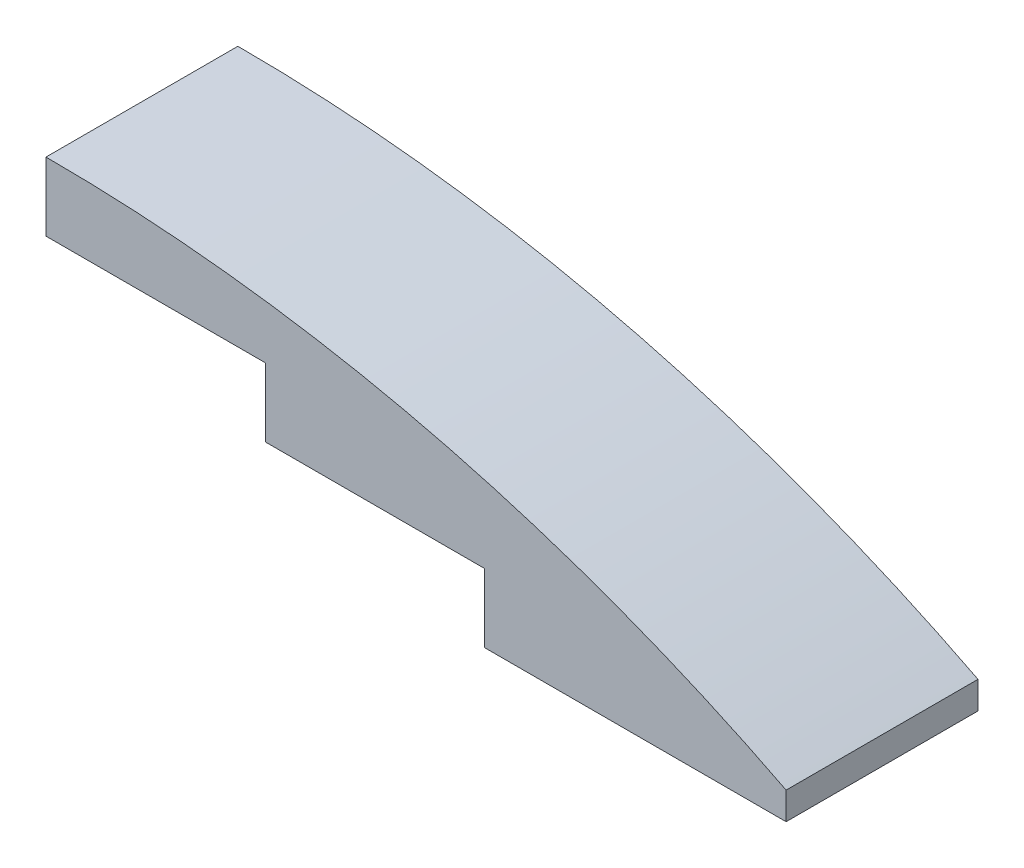
ISO-10303-21;
HEADER;
FILE_DESCRIPTION(('STEP AP214'),'2;1');
FILE_NAME('part.step','',(''),(''),'','','');
FILE_SCHEMA(('AUTOMOTIVE_DESIGN { 1 0 10303 214 1 1 1 1 }'));
ENDSEC;
DATA;
#1=APPLICATION_CONTEXT('core data for automotive mechanical design processes');
#2=APPLICATION_PROTOCOL_DEFINITION('international standard','automotive_design',2000,#1);
#3=PRODUCT_CONTEXT('',#1,'mechanical');
#4=PRODUCT('Part','Part','',(#3));
#5=PRODUCT_RELATED_PRODUCT_CATEGORY('part','',(#4));
#6=PRODUCT_DEFINITION_FORMATION('','',#4);
#7=PRODUCT_DEFINITION_CONTEXT('part definition',#1,'design');
#8=PRODUCT_DEFINITION('design','',#6,#7);
#9=PRODUCT_DEFINITION_SHAPE('','',#8);
#10=(LENGTH_UNIT() NAMED_UNIT(*) SI_UNIT(.MILLI.,.METRE.));
#11=(NAMED_UNIT(*) PLANE_ANGLE_UNIT() SI_UNIT($,.RADIAN.));
#12=(NAMED_UNIT(*) SI_UNIT($,.STERADIAN.) SOLID_ANGLE_UNIT());
#13=UNCERTAINTY_MEASURE_WITH_UNIT(LENGTH_MEASURE(1.E-05),#10,'distance_accuracy_value','');
#14=(GEOMETRIC_REPRESENTATION_CONTEXT(3) GLOBAL_UNCERTAINTY_ASSIGNED_CONTEXT((#13)) GLOBAL_UNIT_ASSIGNED_CONTEXT((#10,
#11,#12)) REPRESENTATION_CONTEXT('',''));
#15=CARTESIAN_POINT('',(0.,0.,0.));
#16=DIRECTION('',(0.,0.,1.));
#17=DIRECTION('',(1.,0.,0.));
#18=AXIS2_PLACEMENT_3D('',#15,#16,#17);
#19=CARTESIAN_POINT('',(0.,-75.3451923076923,4.445));
#20=DIRECTION('',(0.,0.,-1.));
#21=DIRECTION('',(-1.,0.,0.));
#22=AXIS2_PLACEMENT_3D('',#19,#20,#21);
#23=CYLINDRICAL_SURFACE('',#22,75.3451923076923);
#24=CARTESIAN_POINT('',(0.,-75.3451923076923,-4.445));
#25=DIRECTION('',(0.,0.,1.));
#26=DIRECTION('',(-1.,0.,0.));
#27=AXIS2_PLACEMENT_3D('',#24,#25,#26);
#28=CIRCLE('',#27,75.3451923076923);
#29=CARTESIAN_POINT('',(34.29,-8.255,-4.445));
#30=VERTEX_POINT('',#29);
#31=CARTESIAN_POINT('',(0.,0.,-4.445));
#32=VERTEX_POINT('',#31);
#33=EDGE_CURVE('E255',#30,#32,#28,.T.);
#34=ORIENTED_EDGE('',*,*,#33,.T.);
#35=DIRECTION('',(0.,0.,-1.));
#36=VECTOR('',#35,1.);
#37=CARTESIAN_POINT('',(0.,0.,4.445));
#38=LINE('',#37,#36);
#39=CARTESIAN_POINT('',(0.,0.,4.445));
#40=VERTEX_POINT('',#39);
#41=EDGE_CURVE('E12',#40,#32,#38,.T.);
#42=ORIENTED_EDGE('',*,*,#41,.F.);
#43=CARTESIAN_POINT('',(0.,-75.3451923076923,4.445));
#44=DIRECTION('',(0.,0.,1.));
#45=DIRECTION('',(-1.,0.,0.));
#46=AXIS2_PLACEMENT_3D('',#43,#44,#45);
#47=CIRCLE('',#46,75.3451923076923);
#48=CARTESIAN_POINT('',(34.29,-8.255,4.445));
#49=VERTEX_POINT('',#48);
#50=EDGE_CURVE('E256',#49,#40,#47,.T.);
#51=ORIENTED_EDGE('',*,*,#50,.F.);
#52=DIRECTION('',(0.,0.,-1.));
#53=VECTOR('',#52,1.);
#54=CARTESIAN_POINT('',(34.29,-8.255,4.445));
#55=LINE('',#54,#53);
#56=EDGE_CURVE('E274',#49,#30,#55,.T.);
#57=ORIENTED_EDGE('',*,*,#56,.T.);
#58=EDGE_LOOP('',(#34,#42,#51,#57));
#59=FACE_BOUND('',#58,.T.);
#60=ADVANCED_FACE('F35',(#59),#23,.T.);
#61=CARTESIAN_POINT('',(0.,0.,4.445));
#62=DIRECTION('',(1.,0.,0.));
#63=DIRECTION('',(0.,1.,0.));
#64=AXIS2_PLACEMENT_3D('',#61,#62,#63);
#65=PLANE('',#64);
#66=DIRECTION('',(0.,-1.,0.));
#67=VECTOR('',#66,1.);
#68=CARTESIAN_POINT('',(0.,0.,-4.445));
#69=LINE('',#68,#67);
#70=CARTESIAN_POINT('',(0.,-3.175,-4.445));
#71=VERTEX_POINT('',#70);
#72=EDGE_CURVE('E277',#32,#71,#69,.T.);
#73=ORIENTED_EDGE('',*,*,#72,.T.);
#74=DIRECTION('',(0.,0.,-1.));
#75=VECTOR('',#74,1.);
#76=CARTESIAN_POINT('',(0.,-3.175,4.445));
#77=LINE('',#76,#75);
#78=CARTESIAN_POINT('',(0.,-3.175,4.445));
#79=VERTEX_POINT('',#78);
#80=EDGE_CURVE('E42',#79,#71,#77,.T.);
#81=ORIENTED_EDGE('',*,*,#80,.F.);
#82=DIRECTION('',(0.,-1.,0.));
#83=VECTOR('',#82,1.);
#84=CARTESIAN_POINT('',(0.,0.,4.445));
#85=LINE('',#84,#83);
#86=EDGE_CURVE('E259',#40,#79,#85,.T.);
#87=ORIENTED_EDGE('',*,*,#86,.F.);
#88=ORIENTED_EDGE('',*,*,#41,.T.);
#89=EDGE_LOOP('',(#73,#81,#87,#88));
#90=FACE_BOUND('',#89,.T.);
#91=ADVANCED_FACE('F370',(#90),#65,.F.);
#92=CARTESIAN_POINT('',(0.,-3.175,4.445));
#93=DIRECTION('',(0.,1.,0.));
#94=DIRECTION('',(0.,0.,1.));
#95=AXIS2_PLACEMENT_3D('',#92,#93,#94);
#96=PLANE('',#95);
#97=DIRECTION('',(0.,0.,-1.));
#98=VECTOR('',#97,1.);
#99=CARTESIAN_POINT('',(0.3175,-3.175,0.));
#100=LINE('',#99,#98);
#101=CARTESIAN_POINT('',(0.3175,-3.175,4.1275));
#102=VERTEX_POINT('',#101);
#103=CARTESIAN_POINT('',(0.3175,-3.175,-4.1275));
#104=VERTEX_POINT('',#103);
#105=EDGE_CURVE('E241',#102,#104,#100,.T.);
#106=ORIENTED_EDGE('',*,*,#105,.F.);
#107=DIRECTION('',(-1.,0.,0.));
#108=VECTOR('',#107,1.);
#109=CARTESIAN_POINT('',(0.,-3.175,4.1275));
#110=LINE('',#109,#108);
#111=CARTESIAN_POINT('',(10.16,-3.175,4.1275));
#112=VERTEX_POINT('',#111);
#113=EDGE_CURVE('E230',#112,#102,#110,.T.);
#114=ORIENTED_EDGE('',*,*,#113,.F.);
#115=DIRECTION('',(0.,0.,-1.));
#116=VECTOR('',#115,1.);
#117=CARTESIAN_POINT('',(10.16,-3.175,4.445));
#118=LINE('',#117,#116);
#119=CARTESIAN_POINT('',(10.16,-3.175,4.445));
#120=VERTEX_POINT('',#119);
#121=EDGE_CURVE('E308',#120,#112,#118,.T.);
#122=ORIENTED_EDGE('',*,*,#121,.F.);
#123=DIRECTION('',(1.,0.,0.));
#124=VECTOR('',#123,1.);
#125=CARTESIAN_POINT('',(0.,-3.175,4.445));
#126=LINE('',#125,#124);
#127=EDGE_CURVE('E262',#79,#120,#126,.T.);
#128=ORIENTED_EDGE('',*,*,#127,.F.);
#129=ORIENTED_EDGE('',*,*,#80,.T.);
#130=DIRECTION('',(1.,0.,0.));
#131=VECTOR('',#130,1.);
#132=CARTESIAN_POINT('',(0.,-3.175,-4.445));
#133=LINE('',#132,#131);
#134=CARTESIAN_POINT('',(10.16,-3.175,-4.445));
#135=VERTEX_POINT('',#134);
#136=EDGE_CURVE('E279',#71,#135,#133,.T.);
#137=ORIENTED_EDGE('',*,*,#136,.T.);
#138=CARTESIAN_POINT('',(10.16,-3.175,-4.1275));
#139=VERTEX_POINT('',#138);
#140=EDGE_CURVE('E307',#139,#135,#118,.T.);
#141=ORIENTED_EDGE('',*,*,#140,.F.);
#142=DIRECTION('',(1.,0.,0.));
#143=VECTOR('',#142,1.);
#144=CARTESIAN_POINT('',(0.,-3.175,-4.1275));
#145=LINE('',#144,#143);
#146=EDGE_CURVE('E244',#104,#139,#145,.T.);
#147=ORIENTED_EDGE('',*,*,#146,.F.);
#148=EDGE_LOOP('',(#106,#114,#122,#128,#129,#137,#141,#147));
#149=FACE_BOUND('',#148,.T.);
#150=ADVANCED_FACE('F316',(#149),#96,.F.);
#151=CARTESIAN_POINT('',(10.16,-3.175,4.445));
#152=DIRECTION('',(1.,0.,0.));
#153=DIRECTION('',(0.,1.,0.));
#154=AXIS2_PLACEMENT_3D('',#151,#152,#153);
#155=PLANE('',#154);
#156=DIRECTION('',(0.,-1.,0.));
#157=VECTOR('',#156,1.);
#158=CARTESIAN_POINT('',(10.16,-3.175,-4.445));
#159=LINE('',#158,#157);
#160=CARTESIAN_POINT('',(10.16,-6.35,-4.445));
#161=VERTEX_POINT('',#160);
#162=EDGE_CURVE('E282',#135,#161,#159,.T.);
#163=ORIENTED_EDGE('',*,*,#162,.T.);
#164=DIRECTION('',(0.,0.,-1.));
#165=VECTOR('',#164,1.);
#166=CARTESIAN_POINT('',(10.16,-6.35,4.445));
#167=LINE('',#166,#165);
#168=CARTESIAN_POINT('',(10.16,-6.35,4.445));
#169=VERTEX_POINT('',#168);
#170=EDGE_CURVE('E304',#169,#161,#167,.T.);
#171=ORIENTED_EDGE('',*,*,#170,.F.);
#172=DIRECTION('',(0.,-1.,0.));
#173=VECTOR('',#172,1.);
#174=CARTESIAN_POINT('',(10.16,-3.175,4.445));
#175=LINE('',#174,#173);
#176=EDGE_CURVE('E264',#120,#169,#175,.T.);
#177=ORIENTED_EDGE('',*,*,#176,.F.);
#178=ORIENTED_EDGE('',*,*,#121,.T.);
#179=DIRECTION('',(0.,-1.,0.));
#180=VECTOR('',#179,1.);
#181=CARTESIAN_POINT('',(10.16,2.541,4.1275));
#182=LINE('',#181,#180);
#183=CARTESIAN_POINT('',(10.16,-1.97007039691387,4.1275));
#184=VERTEX_POINT('',#183);
#185=EDGE_CURVE('E234',#184,#112,#182,.T.);
#186=ORIENTED_EDGE('',*,*,#185,.F.);
#187=DIRECTION('',(0.,0.,-1.));
#188=VECTOR('',#187,1.);
#189=CARTESIAN_POINT('',(10.16,-1.97007039691387,4.445));
#190=LINE('',#189,#188);
#191=CARTESIAN_POINT('',(10.16,-1.97007039691387,-4.1275));
#192=VERTEX_POINT('',#191);
#193=EDGE_CURVE('E233',#184,#192,#190,.T.);
#194=ORIENTED_EDGE('',*,*,#193,.T.);
#195=DIRECTION('',(0.,-1.,0.));
#196=VECTOR('',#195,1.);
#197=CARTESIAN_POINT('',(10.16,2.541,-4.1275));
#198=LINE('',#197,#196);
#199=EDGE_CURVE('E248',#192,#139,#198,.T.);
#200=ORIENTED_EDGE('',*,*,#199,.T.);
#201=ORIENTED_EDGE('',*,*,#140,.T.);
#202=EDGE_LOOP('',(#163,#171,#177,#178,#186,#194,#200,#201));
#203=FACE_BOUND('',#202,.T.);
#204=ADVANCED_FACE('F328',(#203),#155,.F.);
#205=CARTESIAN_POINT('',(10.16,-6.35,4.445));
#206=DIRECTION('',(0.,1.,0.));
#207=DIRECTION('',(0.,0.,1.));
#208=AXIS2_PLACEMENT_3D('',#205,#206,#207);
#209=PLANE('',#208);
#210=DIRECTION('',(0.,0.,-1.));
#211=VECTOR('',#210,1.);
#212=CARTESIAN_POINT('',(10.4775,-6.35,0.));
#213=LINE('',#212,#211);
#214=CARTESIAN_POINT('',(10.4775,-6.35,4.1275));
#215=VERTEX_POINT('',#214);
#216=CARTESIAN_POINT('',(10.4775,-6.35,-4.1275));
#217=VERTEX_POINT('',#216);
#218=EDGE_CURVE('E199',#215,#217,#213,.T.);
#219=ORIENTED_EDGE('',*,*,#218,.F.);
#220=DIRECTION('',(-1.,0.,0.));
#221=VECTOR('',#220,1.);
#222=CARTESIAN_POINT('',(0.,-6.35,4.1275));
#223=LINE('',#222,#221);
#224=CARTESIAN_POINT('',(20.32,-6.35,4.1275));
#225=VERTEX_POINT('',#224);
#226=EDGE_CURVE('E195',#225,#215,#223,.T.);
#227=ORIENTED_EDGE('',*,*,#226,.F.);
#228=DIRECTION('',(0.,0.,-1.));
#229=VECTOR('',#228,1.);
#230=CARTESIAN_POINT('',(20.32,-6.35,4.445));
#231=LINE('',#230,#229);
#232=CARTESIAN_POINT('',(20.32,-6.35,4.445));
#233=VERTEX_POINT('',#232);
#234=EDGE_CURVE('E301',#233,#225,#231,.T.);
#235=ORIENTED_EDGE('',*,*,#234,.F.);
#236=DIRECTION('',(1.,0.,0.));
#237=VECTOR('',#236,1.);
#238=CARTESIAN_POINT('',(10.16,-6.35,4.445));
#239=LINE('',#238,#237);
#240=EDGE_CURVE('E266',#169,#233,#239,.T.);
#241=ORIENTED_EDGE('',*,*,#240,.F.);
#242=ORIENTED_EDGE('',*,*,#170,.T.);
#243=DIRECTION('',(1.,0.,0.));
#244=VECTOR('',#243,1.);
#245=CARTESIAN_POINT('',(10.16,-6.35,-4.445));
#246=LINE('',#245,#244);
#247=CARTESIAN_POINT('',(20.32,-6.35,-4.445));
#248=VERTEX_POINT('',#247);
#249=EDGE_CURVE('E284',#161,#248,#246,.T.);
#250=ORIENTED_EDGE('',*,*,#249,.T.);
#251=CARTESIAN_POINT('',(20.32,-6.35,-4.1275));
#252=VERTEX_POINT('',#251);
#253=EDGE_CURVE('E300',#252,#248,#231,.T.);
#254=ORIENTED_EDGE('',*,*,#253,.F.);
#255=DIRECTION('',(1.,0.,0.));
#256=VECTOR('',#255,1.);
#257=CARTESIAN_POINT('',(0.,-6.35,-4.1275));
#258=LINE('',#257,#256);
#259=EDGE_CURVE('E57',#217,#252,#258,.T.);
#260=ORIENTED_EDGE('',*,*,#259,.F.);
#261=EDGE_LOOP('',(#219,#227,#235,#241,#242,#250,#254,#260));
#262=FACE_BOUND('',#261,.T.);
#263=ADVANCED_FACE('F333',(#262),#209,.F.);
#264=CARTESIAN_POINT('',(20.32,-6.35,4.445));
#265=DIRECTION('',(1.,0.,0.));
#266=DIRECTION('',(0.,1.,0.));
#267=AXIS2_PLACEMENT_3D('',#264,#265,#266);
#268=PLANE('',#267);
#269=DIRECTION('',(0.,-1.,0.));
#270=VECTOR('',#269,1.);
#271=CARTESIAN_POINT('',(20.32,-6.35,-4.445));
#272=LINE('',#271,#270);
#273=CARTESIAN_POINT('',(20.32,-9.525,-4.445));
#274=VERTEX_POINT('',#273);
#275=EDGE_CURVE('E287',#248,#274,#272,.T.);
#276=ORIENTED_EDGE('',*,*,#275,.T.);
#277=DIRECTION('',(0.,0.,-1.));
#278=VECTOR('',#277,1.);
#279=CARTESIAN_POINT('',(20.32,-9.525,4.445));
#280=LINE('',#279,#278);
#281=CARTESIAN_POINT('',(20.32,-9.525,4.445));
#282=VERTEX_POINT('',#281);
#283=EDGE_CURVE('E297',#282,#274,#280,.T.);
#284=ORIENTED_EDGE('',*,*,#283,.F.);
#285=DIRECTION('',(0.,-1.,0.));
#286=VECTOR('',#285,1.);
#287=CARTESIAN_POINT('',(20.32,-6.35,4.445));
#288=LINE('',#287,#286);
#289=EDGE_CURVE('E268',#233,#282,#288,.T.);
#290=ORIENTED_EDGE('',*,*,#289,.F.);
#291=ORIENTED_EDGE('',*,*,#234,.T.);
#292=DIRECTION('',(0.,-1.,0.));
#293=VECTOR('',#292,1.);
#294=CARTESIAN_POINT('',(20.32,2.541,4.1275));
#295=LINE('',#294,#293);
#296=CARTESIAN_POINT('',(20.32,-4.11155056854212,4.1275));
#297=VERTEX_POINT('',#296);
#298=EDGE_CURVE('E214',#297,#225,#295,.T.);
#299=ORIENTED_EDGE('',*,*,#298,.F.);
#300=DIRECTION('',(0.,0.,-1.));
#301=VECTOR('',#300,1.);
#302=CARTESIAN_POINT('',(20.32,-4.11155056854212,4.445));
#303=LINE('',#302,#301);
#304=CARTESIAN_POINT('',(20.32,-4.11155056854212,-4.1275));
#305=VERTEX_POINT('',#304);
#306=EDGE_CURVE('E213',#297,#305,#303,.T.);
#307=ORIENTED_EDGE('',*,*,#306,.T.);
#308=DIRECTION('',(0.,-1.,0.));
#309=VECTOR('',#308,1.);
#310=CARTESIAN_POINT('',(20.32,2.541,-4.1275));
#311=LINE('',#310,#309);
#312=EDGE_CURVE('E224',#305,#252,#311,.T.);
#313=ORIENTED_EDGE('',*,*,#312,.T.);
#314=ORIENTED_EDGE('',*,*,#253,.T.);
#315=EDGE_LOOP('',(#276,#284,#290,#291,#299,#307,#313,#314));
#316=FACE_BOUND('',#315,.T.);
#317=ADVANCED_FACE('F388',(#316),#268,.F.);
#318=CARTESIAN_POINT('',(20.32,-9.525,4.445));
#319=DIRECTION('',(0.,1.,0.));
#320=DIRECTION('',(0.,0.,1.));
#321=AXIS2_PLACEMENT_3D('',#318,#319,#320);
#322=PLANE('',#321);
#323=DIRECTION('',(0.,0.,-1.));
#324=VECTOR('',#323,1.);
#325=CARTESIAN_POINT('',(20.6375,-9.525,0.));
#326=LINE('',#325,#324);
#327=CARTESIAN_POINT('',(20.6375,-9.525,4.1275));
#328=VERTEX_POINT('',#327);
#329=CARTESIAN_POINT('',(20.6375,-9.525,-4.1275));
#330=VERTEX_POINT('',#329);
#331=EDGE_CURVE('E177',#328,#330,#326,.T.);
#332=ORIENTED_EDGE('',*,*,#331,.F.);
#333=DIRECTION('',(-1.,0.,0.));
#334=VECTOR('',#333,1.);
#335=CARTESIAN_POINT('',(0.,-9.525,4.1275));
#336=LINE('',#335,#334);
#337=CARTESIAN_POINT('',(33.9725,-9.525,4.1275));
#338=VERTEX_POINT('',#337);
#339=EDGE_CURVE('E49',#338,#328,#336,.T.);
#340=ORIENTED_EDGE('',*,*,#339,.F.);
#341=DIRECTION('',(0.,0.,1.));
#342=VECTOR('',#341,1.);
#343=CARTESIAN_POINT('',(33.9725,-9.525,0.));
#344=LINE('',#343,#342);
#345=CARTESIAN_POINT('',(33.9725,-9.525,-4.1275));
#346=VERTEX_POINT('',#345);
#347=EDGE_CURVE('E191',#346,#338,#344,.T.);
#348=ORIENTED_EDGE('',*,*,#347,.F.);
#349=DIRECTION('',(1.,0.,0.));
#350=VECTOR('',#349,1.);
#351=CARTESIAN_POINT('',(0.,-9.525,-4.1275));
#352=LINE('',#351,#350);
#353=EDGE_CURVE('E579',#330,#346,#352,.T.);
#354=ORIENTED_EDGE('',*,*,#353,.F.);
#355=EDGE_LOOP('',(#332,#340,#348,#354));
#356=FACE_BOUND('',#355,.T.);
#357=DIRECTION('',(1.,0.,0.));
#358=VECTOR('',#357,1.);
#359=CARTESIAN_POINT('',(20.32,-9.525,-4.445));
#360=LINE('',#359,#358);
#361=CARTESIAN_POINT('',(34.29,-9.525,-4.445));
#362=VERTEX_POINT('',#361);
#363=EDGE_CURVE('E289',#274,#362,#360,.T.);
#364=ORIENTED_EDGE('',*,*,#363,.T.);
#365=DIRECTION('',(0.,0.,-1.));
#366=VECTOR('',#365,1.);
#367=CARTESIAN_POINT('',(34.29,-9.525,4.445));
#368=LINE('',#367,#366);
#369=CARTESIAN_POINT('',(34.29,-9.525,4.445));
#370=VERTEX_POINT('',#369);
#371=EDGE_CURVE('E294',#370,#362,#368,.T.);
#372=ORIENTED_EDGE('',*,*,#371,.F.);
#373=DIRECTION('',(1.,0.,0.));
#374=VECTOR('',#373,1.);
#375=CARTESIAN_POINT('',(20.32,-9.525,4.445));
#376=LINE('',#375,#374);
#377=EDGE_CURVE('E270',#282,#370,#376,.T.);
#378=ORIENTED_EDGE('',*,*,#377,.F.);
#379=ORIENTED_EDGE('',*,*,#283,.T.);
#380=EDGE_LOOP('',(#364,#372,#378,#379));
#381=FACE_BOUND('',#380,.T.);
#382=ADVANCED_FACE('F386',(#356,#381),#322,.F.);
#383=CARTESIAN_POINT('',(34.29,-9.525,4.445));
#384=DIRECTION('',(-1.,0.,0.));
#385=DIRECTION('',(0.,0.,1.));
#386=AXIS2_PLACEMENT_3D('',#383,#384,#385);
#387=PLANE('',#386);
#388=DIRECTION('',(0.,1.,0.));
#389=VECTOR('',#388,1.);
#390=CARTESIAN_POINT('',(34.29,-9.525,-4.445));
#391=LINE('',#390,#389);
#392=EDGE_CURVE('E260',#362,#30,#391,.T.);
#393=ORIENTED_EDGE('',*,*,#392,.T.);
#394=ORIENTED_EDGE('',*,*,#56,.F.);
#395=DIRECTION('',(0.,1.,0.));
#396=VECTOR('',#395,1.);
#397=CARTESIAN_POINT('',(34.29,-9.525,4.445));
#398=LINE('',#397,#396);
#399=EDGE_CURVE('E272',#370,#49,#398,.T.);
#400=ORIENTED_EDGE('',*,*,#399,.F.);
#401=ORIENTED_EDGE('',*,*,#371,.T.);
#402=EDGE_LOOP('',(#393,#394,#400,#401));
#403=FACE_BOUND('',#402,.T.);
#404=ADVANCED_FACE('F381',(#403),#387,.F.);
#405=CARTESIAN_POINT('',(0.,-75.3451923076923,4.445));
#406=DIRECTION('',(0.,0.,-1.));
#407=DIRECTION('',(-1.,0.,0.));
#408=AXIS2_PLACEMENT_3D('',#405,#406,#407);
#409=PLANE('',#408);
#410=ORIENTED_EDGE('',*,*,#50,.T.);
#411=ORIENTED_EDGE('',*,*,#86,.T.);
#412=ORIENTED_EDGE('',*,*,#127,.T.);
#413=ORIENTED_EDGE('',*,*,#176,.T.);
#414=ORIENTED_EDGE('',*,*,#240,.T.);
#415=ORIENTED_EDGE('',*,*,#289,.T.);
#416=ORIENTED_EDGE('',*,*,#377,.T.);
#417=ORIENTED_EDGE('',*,*,#399,.T.);
#418=EDGE_LOOP('',(#410,#411,#412,#413,#414,#415,#416,#417));
#419=FACE_BOUND('',#418,.T.);
#420=ADVANCED_FACE('F339',(#419),#409,.F.);
#421=CARTESIAN_POINT('',(0.,-75.3451923076923,-4.445));
#422=DIRECTION('',(0.,0.,-1.));
#423=DIRECTION('',(-1.,0.,0.));
#424=AXIS2_PLACEMENT_3D('',#421,#422,#423);
#425=PLANE('',#424);
#426=ORIENTED_EDGE('',*,*,#33,.F.);
#427=ORIENTED_EDGE('',*,*,#392,.F.);
#428=ORIENTED_EDGE('',*,*,#363,.F.);
#429=ORIENTED_EDGE('',*,*,#275,.F.);
#430=ORIENTED_EDGE('',*,*,#249,.F.);
#431=ORIENTED_EDGE('',*,*,#162,.F.);
#432=ORIENTED_EDGE('',*,*,#136,.F.);
#433=ORIENTED_EDGE('',*,*,#72,.F.);
#434=EDGE_LOOP('',(#426,#427,#428,#429,#430,#431,#432,#433));
#435=FACE_BOUND('',#434,.T.);
#436=ADVANCED_FACE('F323',(#435),#425,.T.);
#437=CARTESIAN_POINT('',(0.,2.541,4.1275));
#438=DIRECTION('',(0.,0.,1.));
#439=DIRECTION('',(1.,0.,0.));
#440=AXIS2_PLACEMENT_3D('',#437,#438,#439);
#441=PLANE('',#440);
#442=CARTESIAN_POINT('',(0.,-75.3451923076923,4.1275));
#443=DIRECTION('',(0.,0.,1.));
#444=DIRECTION('',(1.,0.,0.));
#445=AXIS2_PLACEMENT_3D('',#442,#443,#444);
#446=CIRCLE('',#445,74.0751923076923);
#447=CARTESIAN_POINT('',(0.3175,-1.27068043504074,4.1275));
#448=VERTEX_POINT('',#447);
#449=EDGE_CURVE('E236',#448,#184,#446,.F.);
#450=ORIENTED_EDGE('',*,*,#449,.T.);
#451=ORIENTED_EDGE('',*,*,#185,.T.);
#452=ORIENTED_EDGE('',*,*,#113,.T.);
#453=DIRECTION('',(0.,-1.,0.));
#454=VECTOR('',#453,1.);
#455=CARTESIAN_POINT('',(0.3175,2.541,4.1275));
#456=LINE('',#455,#454);
#457=EDGE_CURVE('E246',#448,#102,#456,.T.);
#458=ORIENTED_EDGE('',*,*,#457,.F.);
#459=EDGE_LOOP('',(#450,#451,#452,#458));
#460=FACE_BOUND('',#459,.T.);
#461=ADVANCED_FACE('F346',(#460),#441,.F.);
#462=CARTESIAN_POINT('',(0.,2.541,-4.1275));
#463=DIRECTION('',(0.,0.,-1.));
#464=DIRECTION('',(-1.,0.,0.));
#465=AXIS2_PLACEMENT_3D('',#462,#463,#464);
#466=PLANE('',#465);
#467=CARTESIAN_POINT('',(0.,-75.3451923076923,-4.1275));
#468=DIRECTION('',(0.,0.,-1.));
#469=DIRECTION('',(-1.,0.,0.));
#470=AXIS2_PLACEMENT_3D('',#467,#468,#469);
#471=CIRCLE('',#470,74.0751923076923);
#472=CARTESIAN_POINT('',(0.3175,-1.27068043504074,-4.1275));
#473=VERTEX_POINT('',#472);
#474=EDGE_CURVE('E231',#192,#473,#471,.F.);
#475=ORIENTED_EDGE('',*,*,#474,.T.);
#476=DIRECTION('',(0.,-1.,0.));
#477=VECTOR('',#476,1.);
#478=CARTESIAN_POINT('',(0.3175,2.541,-4.1275));
#479=LINE('',#478,#477);
#480=EDGE_CURVE('E251',#473,#104,#479,.T.);
#481=ORIENTED_EDGE('',*,*,#480,.T.);
#482=ORIENTED_EDGE('',*,*,#146,.T.);
#483=ORIENTED_EDGE('',*,*,#199,.F.);
#484=EDGE_LOOP('',(#475,#481,#482,#483));
#485=FACE_BOUND('',#484,.T.);
#486=ADVANCED_FACE('F355',(#485),#466,.F.);
#487=CARTESIAN_POINT('',(0.3175,2.541,0.));
#488=DIRECTION('',(-1.,0.,0.));
#489=DIRECTION('',(0.,0.,1.));
#490=AXIS2_PLACEMENT_3D('',#487,#488,#489);
#491=PLANE('',#490);
#492=DIRECTION('',(0.,0.,-1.));
#493=VECTOR('',#492,1.);
#494=CARTESIAN_POINT('',(0.3175,-1.27068043504074,4.445));
#495=LINE('',#494,#493);
#496=EDGE_CURVE('E238',#473,#448,#495,.F.);
#497=ORIENTED_EDGE('',*,*,#496,.T.);
#498=ORIENTED_EDGE('',*,*,#457,.T.);
#499=ORIENTED_EDGE('',*,*,#105,.T.);
#500=ORIENTED_EDGE('',*,*,#480,.F.);
#501=EDGE_LOOP('',(#497,#498,#499,#500));
#502=FACE_BOUND('',#501,.T.);
#503=ADVANCED_FACE('F358',(#502),#491,.F.);
#504=CARTESIAN_POINT('',(0.,-75.3451923076923,4.445));
#505=DIRECTION('',(0.,0.,-1.));
#506=DIRECTION('',(-1.,0.,0.));
#507=AXIS2_PLACEMENT_3D('',#504,#505,#506);
#508=CYLINDRICAL_SURFACE('',#507,74.0751923076923);
#509=ORIENTED_EDGE('',*,*,#449,.F.);
#510=ORIENTED_EDGE('',*,*,#496,.F.);
#511=ORIENTED_EDGE('',*,*,#474,.F.);
#512=ORIENTED_EDGE('',*,*,#193,.F.);
#513=EDGE_LOOP('',(#509,#510,#511,#512));
#514=FACE_BOUND('',#513,.T.);
#515=ADVANCED_FACE('F352',(#514),#508,.F.);
#516=CARTESIAN_POINT('',(0.,2.541,4.1275));
#517=DIRECTION('',(0.,0.,1.));
#518=DIRECTION('',(1.,0.,0.));
#519=AXIS2_PLACEMENT_3D('',#516,#517,#518);
#520=PLANE('',#519);
#521=CARTESIAN_POINT('',(0.,-75.3451923076923,4.1275));
#522=DIRECTION('',(0.,0.,1.));
#523=DIRECTION('',(1.,0.,0.));
#524=AXIS2_PLACEMENT_3D('',#521,#522,#523);
#525=CIRCLE('',#524,74.0751923076923);
#526=CARTESIAN_POINT('',(10.4775,-2.01473404394219,4.1275));
#527=VERTEX_POINT('',#526);
#528=EDGE_CURVE('E216',#527,#297,#525,.F.);
#529=ORIENTED_EDGE('',*,*,#528,.T.);
#530=ORIENTED_EDGE('',*,*,#298,.T.);
#531=ORIENTED_EDGE('',*,*,#226,.T.);
#532=DIRECTION('',(0.,-1.,0.));
#533=VECTOR('',#532,1.);
#534=CARTESIAN_POINT('',(10.4775,2.541,4.1275));
#535=LINE('',#534,#533);
#536=EDGE_CURVE('E222',#527,#215,#535,.T.);
#537=ORIENTED_EDGE('',*,*,#536,.F.);
#538=EDGE_LOOP('',(#529,#530,#531,#537));
#539=FACE_BOUND('',#538,.T.);
#540=ADVANCED_FACE('F365',(#539),#520,.F.);
#541=CARTESIAN_POINT('',(0.,2.541,-4.1275));
#542=DIRECTION('',(0.,0.,-1.));
#543=DIRECTION('',(-1.,0.,0.));
#544=AXIS2_PLACEMENT_3D('',#541,#542,#543);
#545=PLANE('',#544);
#546=CARTESIAN_POINT('',(0.,-75.3451923076923,-4.1275));
#547=DIRECTION('',(0.,0.,-1.));
#548=DIRECTION('',(-1.,0.,0.));
#549=AXIS2_PLACEMENT_3D('',#546,#547,#548);
#550=CIRCLE('',#549,74.0751923076923);
#551=CARTESIAN_POINT('',(10.4775,-2.01473404394219,-4.1275));
#552=VERTEX_POINT('',#551);
#553=EDGE_CURVE('E211',#305,#552,#550,.F.);
#554=ORIENTED_EDGE('',*,*,#553,.T.);
#555=DIRECTION('',(0.,-1.,0.));
#556=VECTOR('',#555,1.);
#557=CARTESIAN_POINT('',(10.4775,2.541,-4.1275));
#558=LINE('',#557,#556);
#559=EDGE_CURVE('E226',#552,#217,#558,.T.);
#560=ORIENTED_EDGE('',*,*,#559,.T.);
#561=ORIENTED_EDGE('',*,*,#259,.T.);
#562=ORIENTED_EDGE('',*,*,#312,.F.);
#563=EDGE_LOOP('',(#554,#560,#561,#562));
#564=FACE_BOUND('',#563,.T.);
#565=ADVANCED_FACE('F401',(#564),#545,.F.);
#566=CARTESIAN_POINT('',(10.4775,2.541,0.));
#567=DIRECTION('',(-1.,0.,0.));
#568=DIRECTION('',(0.,0.,1.));
#569=AXIS2_PLACEMENT_3D('',#566,#567,#568);
#570=PLANE('',#569);
#571=DIRECTION('',(0.,0.,-1.));
#572=VECTOR('',#571,1.);
#573=CARTESIAN_POINT('',(10.4775,-2.01473404394219,4.445));
#574=LINE('',#573,#572);
#575=EDGE_CURVE('E217',#552,#527,#574,.F.);
#576=ORIENTED_EDGE('',*,*,#575,.T.);
#577=ORIENTED_EDGE('',*,*,#536,.T.);
#578=ORIENTED_EDGE('',*,*,#218,.T.);
#579=ORIENTED_EDGE('',*,*,#559,.F.);
#580=EDGE_LOOP('',(#576,#577,#578,#579));
#581=FACE_BOUND('',#580,.T.);
#582=ADVANCED_FACE('F391',(#581),#570,.F.);
#583=CARTESIAN_POINT('',(0.,-75.3451923076923,4.445));
#584=DIRECTION('',(0.,0.,-1.));
#585=DIRECTION('',(-1.,0.,0.));
#586=AXIS2_PLACEMENT_3D('',#583,#584,#585);
#587=CYLINDRICAL_SURFACE('',#586,74.0751923076923);
#588=ORIENTED_EDGE('',*,*,#528,.F.);
#589=ORIENTED_EDGE('',*,*,#575,.F.);
#590=ORIENTED_EDGE('',*,*,#553,.F.);
#591=ORIENTED_EDGE('',*,*,#306,.F.);
#592=EDGE_LOOP('',(#588,#589,#590,#591));
#593=FACE_BOUND('',#592,.T.);
#594=ADVANCED_FACE('F400',(#593),#587,.F.);
#595=CARTESIAN_POINT('',(0.,2.541,4.1275));
#596=DIRECTION('',(0.,0.,1.));
#597=DIRECTION('',(1.,0.,0.));
#598=AXIS2_PLACEMENT_3D('',#595,#596,#597);
#599=PLANE('',#598);
#600=CARTESIAN_POINT('',(0.,-76.6151923076923,4.1275));
#601=DIRECTION('',(0.,0.,1.));
#602=DIRECTION('',(1.,0.,0.));
#603=AXIS2_PLACEMENT_3D('',#600,#601,#602);
#604=CIRCLE('',#603,75.3451923076923);
#605=CARTESIAN_POINT('',(20.6375,-4.15146622606483,4.1275));
#606=VERTEX_POINT('',#605);
#607=CARTESIAN_POINT('',(33.9725,-9.36367003768612,4.1275));
#608=VERTEX_POINT('',#607);
#609=EDGE_CURVE('E190',#606,#608,#604,.F.);
#610=ORIENTED_EDGE('',*,*,#609,.T.);
#611=DIRECTION('',(0.,-1.,0.));
#612=VECTOR('',#611,1.);
#613=CARTESIAN_POINT('',(33.9725,2.541,4.1275));
#614=LINE('',#613,#612);
#615=EDGE_CURVE('E206',#608,#338,#614,.T.);
#616=ORIENTED_EDGE('',*,*,#615,.T.);
#617=ORIENTED_EDGE('',*,*,#339,.T.);
#618=DIRECTION('',(0.,-1.,0.));
#619=VECTOR('',#618,1.);
#620=CARTESIAN_POINT('',(20.6375,2.541,4.1275));
#621=LINE('',#620,#619);
#622=EDGE_CURVE('E208',#606,#328,#621,.T.);
#623=ORIENTED_EDGE('',*,*,#622,.F.);
#624=EDGE_LOOP('',(#610,#616,#617,#623));
#625=FACE_BOUND('',#624,.T.);
#626=ADVANCED_FACE('F413',(#625),#599,.F.);
#627=CARTESIAN_POINT('',(33.9725,2.541,0.));
#628=DIRECTION('',(1.,0.,0.));
#629=DIRECTION('',(0.,0.,-1.));
#630=AXIS2_PLACEMENT_3D('',#627,#628,#629);
#631=PLANE('',#630);
#632=DIRECTION('',(0.,0.,-1.));
#633=VECTOR('',#632,1.);
#634=CARTESIAN_POINT('',(33.9725,-9.36367003768612,4.445));
#635=LINE('',#634,#633);
#636=CARTESIAN_POINT('',(33.9725,-9.36367003768612,-4.1275));
#637=VERTEX_POINT('',#636);
#638=EDGE_CURVE('E196',#608,#637,#635,.T.);
#639=ORIENTED_EDGE('',*,*,#638,.T.);
#640=DIRECTION('',(0.,-1.,0.));
#641=VECTOR('',#640,1.);
#642=CARTESIAN_POINT('',(33.9725,2.541,-4.1275));
#643=LINE('',#642,#641);
#644=EDGE_CURVE('E182',#637,#346,#643,.T.);
#645=ORIENTED_EDGE('',*,*,#644,.T.);
#646=ORIENTED_EDGE('',*,*,#347,.T.);
#647=ORIENTED_EDGE('',*,*,#615,.F.);
#648=EDGE_LOOP('',(#639,#645,#646,#647));
#649=FACE_BOUND('',#648,.T.);
#650=ADVANCED_FACE('F418',(#649),#631,.F.);
#651=CARTESIAN_POINT('',(0.,2.541,-4.1275));
#652=DIRECTION('',(0.,0.,-1.));
#653=DIRECTION('',(-1.,0.,0.));
#654=AXIS2_PLACEMENT_3D('',#651,#652,#653);
#655=PLANE('',#654);
#656=CARTESIAN_POINT('',(0.,-76.6151923076923,-4.1275));
#657=DIRECTION('',(0.,0.,-1.));
#658=DIRECTION('',(-1.,0.,0.));
#659=AXIS2_PLACEMENT_3D('',#656,#657,#658);
#660=CIRCLE('',#659,75.3451923076923);
#661=CARTESIAN_POINT('',(20.6375,-4.15146622606483,-4.1275));
#662=VERTEX_POINT('',#661);
#663=EDGE_CURVE('E187',#637,#662,#660,.F.);
#664=ORIENTED_EDGE('',*,*,#663,.T.);
#665=DIRECTION('',(0.,-1.,0.));
#666=VECTOR('',#665,1.);
#667=CARTESIAN_POINT('',(20.6375,2.541,-4.1275));
#668=LINE('',#667,#666);
#669=EDGE_CURVE('E172',#662,#330,#668,.T.);
#670=ORIENTED_EDGE('',*,*,#669,.T.);
#671=ORIENTED_EDGE('',*,*,#353,.T.);
#672=ORIENTED_EDGE('',*,*,#644,.F.);
#673=EDGE_LOOP('',(#664,#670,#671,#672));
#674=FACE_BOUND('',#673,.T.);
#675=ADVANCED_FACE('F193',(#674),#655,.F.);
#676=CARTESIAN_POINT('',(20.6375,2.541,0.));
#677=DIRECTION('',(-1.,0.,0.));
#678=DIRECTION('',(0.,0.,1.));
#679=AXIS2_PLACEMENT_3D('',#676,#677,#678);
#680=PLANE('',#679);
#681=DIRECTION('',(0.,0.,-1.));
#682=VECTOR('',#681,1.);
#683=CARTESIAN_POINT('',(20.6375,-4.15146622606483,4.445));
#684=LINE('',#683,#682);
#685=EDGE_CURVE('E175',#662,#606,#684,.F.);
#686=ORIENTED_EDGE('',*,*,#685,.T.);
#687=ORIENTED_EDGE('',*,*,#622,.T.);
#688=ORIENTED_EDGE('',*,*,#331,.T.);
#689=ORIENTED_EDGE('',*,*,#669,.F.);
#690=EDGE_LOOP('',(#686,#687,#688,#689));
#691=FACE_BOUND('',#690,.T.);
#692=ADVANCED_FACE('F174',(#691),#680,.F.);
#693=CARTESIAN_POINT('',(0.,-76.6151923076923,4.445));
#694=DIRECTION('',(0.,0.,-1.));
#695=DIRECTION('',(-1.,0.,0.));
#696=AXIS2_PLACEMENT_3D('',#693,#694,#695);
#697=CYLINDRICAL_SURFACE('',#696,75.3451923076923);
#698=ORIENTED_EDGE('',*,*,#685,.F.);
#699=ORIENTED_EDGE('',*,*,#663,.F.);
#700=ORIENTED_EDGE('',*,*,#638,.F.);
#701=ORIENTED_EDGE('',*,*,#609,.F.);
#702=EDGE_LOOP('',(#698,#699,#700,#701));
#703=FACE_BOUND('',#702,.T.);
#704=ADVANCED_FACE('F186',(#703),#697,.F.);
#705=CLOSED_SHELL('',(#60,#91,#150,#204,#263,#317,#382,#404,#420,#436,#461,#486,#503,#515,#540,
#565,#582,#594,#626,#650,#675,#692,#704));
#706=MANIFOLD_SOLID_BREP('B2',#705);
#707=ADVANCED_BREP_SHAPE_REPRESENTATION('',(#18,#706),#14);
#708=SHAPE_DEFINITION_REPRESENTATION(#9,#707);
ENDSEC;
END-ISO-10303-21;
